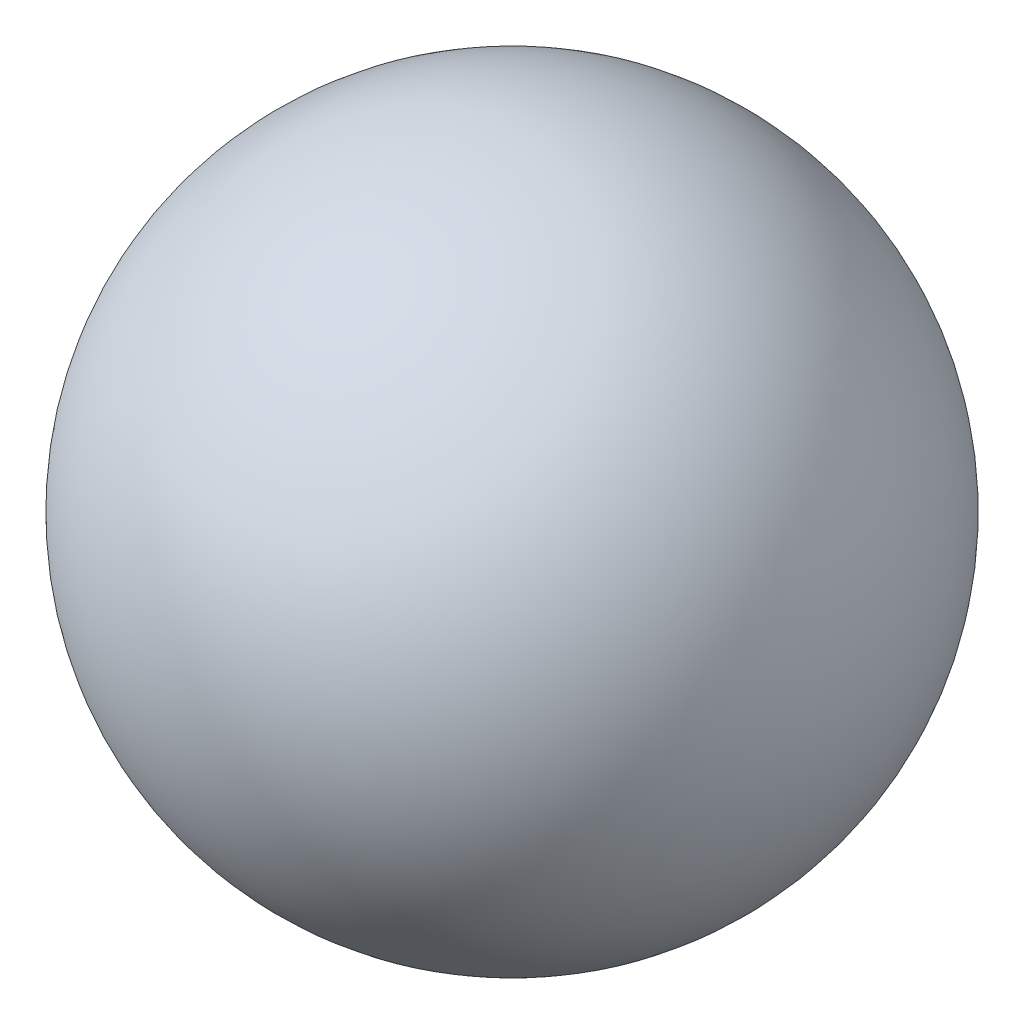
ISO-10303-21;
HEADER;
FILE_DESCRIPTION(('STEP AP214'),'2;1');
FILE_NAME('part.step','',(''),(''),'','','');
FILE_SCHEMA(('AUTOMOTIVE_DESIGN { 1 0 10303 214 1 1 1 1 }'));
ENDSEC;
DATA;
#1=APPLICATION_CONTEXT('core data for automotive mechanical design processes');
#2=APPLICATION_PROTOCOL_DEFINITION('international standard','automotive_design',2000,#1);
#3=PRODUCT_CONTEXT('',#1,'mechanical');
#4=PRODUCT('Part','Part','',(#3));
#5=PRODUCT_RELATED_PRODUCT_CATEGORY('part','',(#4));
#6=PRODUCT_DEFINITION_FORMATION('','',#4);
#7=PRODUCT_DEFINITION_CONTEXT('part definition',#1,'design');
#8=PRODUCT_DEFINITION('design','',#6,#7);
#9=PRODUCT_DEFINITION_SHAPE('','',#8);
#10=(LENGTH_UNIT() NAMED_UNIT(*) SI_UNIT(.MILLI.,.METRE.));
#11=(NAMED_UNIT(*) PLANE_ANGLE_UNIT() SI_UNIT($,.RADIAN.));
#12=(NAMED_UNIT(*) SI_UNIT($,.STERADIAN.) SOLID_ANGLE_UNIT());
#13=UNCERTAINTY_MEASURE_WITH_UNIT(LENGTH_MEASURE(1.E-05),#10,'distance_accuracy_value','');
#14=(GEOMETRIC_REPRESENTATION_CONTEXT(3) GLOBAL_UNCERTAINTY_ASSIGNED_CONTEXT((#13)) GLOBAL_UNIT_ASSIGNED_CONTEXT((#10,
#11,#12)) REPRESENTATION_CONTEXT('',''));
#15=CARTESIAN_POINT('',(0.,0.,0.));
#16=DIRECTION('',(0.,0.,1.));
#17=DIRECTION('',(1.,0.,0.));
#18=AXIS2_PLACEMENT_3D('',#15,#16,#17);
#19=CARTESIAN_POINT('',(0.,0.,0.));
#20=DIRECTION('',(0.,1.,0.));
#21=DIRECTION('',(1.,0.,0.));
#22=AXIS2_PLACEMENT_3D('',#19,#20,#21);
#23=SPHERICAL_SURFACE('',#22,62.3223959299587);
#24=CARTESIAN_POINT('',(0.,62.3223959299587,0.));
#25=VERTEX_POINT('',#24);
#26=VERTEX_LOOP('',#25);
#27=FACE_BOUND('',#26,.T.);
#28=ADVANCED_FACE('F29',(#27),#23,.T.);
#29=CLOSED_SHELL('',(#28));
#30=MANIFOLD_SOLID_BREP('B2',#29);
#31=ADVANCED_BREP_SHAPE_REPRESENTATION('',(#18,#30),#14);
#32=SHAPE_DEFINITION_REPRESENTATION(#9,#31);
ENDSEC;
END-ISO-10303-21;
